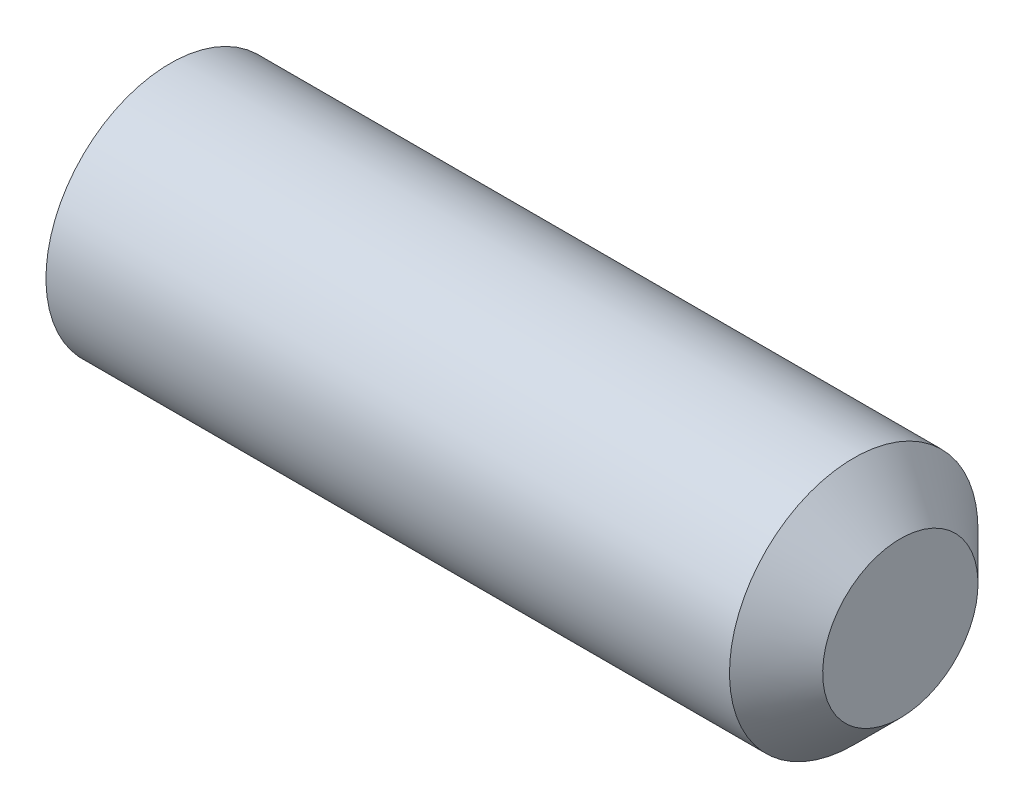
ISO-10303-21;
HEADER;
FILE_DESCRIPTION(('STEP AP214'),'2;1');
FILE_NAME('part.step','',(''),(''),'','','');
FILE_SCHEMA(('AUTOMOTIVE_DESIGN { 1 0 10303 214 1 1 1 1 }'));
ENDSEC;
DATA;
#1=APPLICATION_CONTEXT('core data for automotive mechanical design processes');
#2=APPLICATION_PROTOCOL_DEFINITION('international standard','automotive_design',2000,#1);
#3=PRODUCT_CONTEXT('',#1,'mechanical');
#4=PRODUCT('Part','Part','',(#3));
#5=PRODUCT_RELATED_PRODUCT_CATEGORY('part','',(#4));
#6=PRODUCT_DEFINITION_FORMATION('','',#4);
#7=PRODUCT_DEFINITION_CONTEXT('part definition',#1,'design');
#8=PRODUCT_DEFINITION('design','',#6,#7);
#9=PRODUCT_DEFINITION_SHAPE('','',#8);
#10=(LENGTH_UNIT() NAMED_UNIT(*) SI_UNIT(.MILLI.,.METRE.));
#11=(NAMED_UNIT(*) PLANE_ANGLE_UNIT() SI_UNIT($,.RADIAN.));
#12=(NAMED_UNIT(*) SI_UNIT($,.STERADIAN.) SOLID_ANGLE_UNIT());
#13=UNCERTAINTY_MEASURE_WITH_UNIT(LENGTH_MEASURE(1.E-05),#10,'distance_accuracy_value','');
#14=(GEOMETRIC_REPRESENTATION_CONTEXT(3) GLOBAL_UNCERTAINTY_ASSIGNED_CONTEXT((#13)) GLOBAL_UNIT_ASSIGNED_CONTEXT((#10,
#11,#12)) REPRESENTATION_CONTEXT('',''));
#15=CARTESIAN_POINT('',(0.,0.,0.));
#16=DIRECTION('',(0.,0.,1.));
#17=DIRECTION('',(1.,0.,0.));
#18=AXIS2_PLACEMENT_3D('',#15,#16,#17);
#19=CARTESIAN_POINT('',(0.66666666666667,0.,0.));
#20=DIRECTION('',(-1.,0.,0.));
#21=DIRECTION('',(0.,-1.,0.));
#22=AXIS2_PLACEMENT_3D('',#19,#20,#21);
#23=CONICAL_SURFACE('',#22,0.,1.04719755119661);
#24=CARTESIAN_POINT('',(0.,0.,0.));
#25=DIRECTION('',(-1.,0.,0.));
#26=DIRECTION('',(0.,-1.,0.));
#27=AXIS2_PLACEMENT_3D('',#24,#25,#26);
#28=CIRCLE('',#27,1.1547005383793);
#29=CARTESIAN_POINT('',(0.,0.,1.1547005383793));
#30=VERTEX_POINT('',#29);
#31=CARTESIAN_POINT('',(0.,1.00000000000008,0.577350269189584));
#32=VERTEX_POINT('',#31);
#33=EDGE_CURVE('E133',#30,#32,#28,.T.);
#34=ORIENTED_EDGE('',*,*,#33,.T.);
#35=CARTESIAN_POINT('',(-6.66766656399386E-05,1.0002,0.577234799135792));
#36=CARTESIAN_POINT('',(0.0145910263508786,0.956252680601721,0.602607795820553));
#37=CARTESIAN_POINT('',(0.0279222763791292,0.911926016050181,0.628199807531665));
#38=CARTESIAN_POINT('',(0.0511934923765662,0.822504925328881,0.679827098330841));
#39=CARTESIAN_POINT('',(0.0611252234502379,0.777408908798272,0.70586329561417));
#40=CARTESIAN_POINT('',(0.0765873051179379,0.687775829477387,0.757612978088382));
#41=CARTESIAN_POINT('',(0.0822205319010621,0.643252567766787,0.783318495222199));
#42=CARTESIAN_POINT('',(0.0889487113597592,0.55399626028499,0.83485064837369));
#43=CARTESIAN_POINT('',(0.0900492320783482,0.509263539518514,0.860677096749802));
#44=CARTESIAN_POINT('',(0.0877749477018722,0.425658889182662,0.908946264126714));
#45=CARTESIAN_POINT('',(0.0849585611365999,0.386774523211241,0.931396163287584));
#46=CARTESIAN_POINT('',(0.076027549782657,0.30925915501482,0.976149681982124));
#47=CARTESIAN_POINT('',(0.0699098662457068,0.270628421438366,0.998453146411484));
#48=CARTESIAN_POINT('',(0.0546142742741816,0.192952883515859,1.0432991391405));
#49=CARTESIAN_POINT('',(0.0453714478310434,0.153917923728835,1.06583598368134));
#50=CARTESIAN_POINT('',(0.0243931542444718,0.0764306187239892,1.11057330008467));
#51=CARTESIAN_POINT('',(0.012662624866338,0.0379772787061413,1.13277434629522));
#52=CARTESIAN_POINT('',(-6.66766656665625E-05,-0.000200000000000213,1.15481600843314));
#53=B_SPLINE_CURVE_WITH_KNOTS('',3,(#35,#36,#37,#38,#39,#40,#41,#42,#43,#44,#45,#46,#47,#48,#49,
#50,#51,#52),.UNSPECIFIED.,.F.,.F.,(4,2,2,2,2,2,2,2,4),(0.,0.158523820030115,0.317428970089341,
0.472400167924632,0.627180939971647,0.762016584872715,0.896977373984243,1.03493410168669,
1.17261952416174),.UNSPECIFIED.);
#54=EDGE_CURVE('E11',#32,#30,#53,.T.);
#55=ORIENTED_EDGE('',*,*,#54,.T.);
#56=EDGE_LOOP('',(#34,#55));
#57=FACE_BOUND('',#56,.T.);
#58=ADVANCED_FACE('F31',(#57),#23,.F.);
#59=CARTESIAN_POINT('',(0.,-1.,0.57735026918963));
#60=VERTEX_POINT('',#59);
#61=EDGE_CURVE('E129',#60,#30,#28,.T.);
#62=ORIENTED_EDGE('',*,*,#61,.T.);
#63=CARTESIAN_POINT('',(-6.66766656665343E-05,0.000199999999999947,1.15481600843314));
#64=CARTESIAN_POINT('',(0.0145910263508542,-0.0437473193982806,1.12944301174838));
#65=CARTESIAN_POINT('',(0.0279222763791071,-0.0880739839498216,1.10385100003726));
#66=CARTESIAN_POINT('',(0.0511934923765488,-0.177495074671125,1.05222370923809));
#67=CARTESIAN_POINT('',(0.0611252234502229,-0.222591091201735,1.02618751195476));
#68=CARTESIAN_POINT('',(0.0765873051179279,-0.312224170522623,0.974437829480542));
#69=CARTESIAN_POINT('',(0.0822205319010547,-0.356747432233225,0.948732312346724));
#70=CARTESIAN_POINT('',(0.0889487113597567,-0.446003739715024,0.897200159195231));
#71=CARTESIAN_POINT('',(0.0900492320783479,-0.490736460481502,0.871373710819119));
#72=CARTESIAN_POINT('',(0.0877749477018758,-0.574341110817354,0.823104543442207));
#73=CARTESIAN_POINT('',(0.0849585611366055,-0.613225476788773,0.800654644281338));
#74=CARTESIAN_POINT('',(0.0760275497826669,-0.690740844985192,0.755901125586799));
#75=CARTESIAN_POINT('',(0.0699098662457189,-0.729371578561644,0.73359766115744));
#76=CARTESIAN_POINT('',(0.054614274274198,-0.807047116484148,0.68875166842843));
#77=CARTESIAN_POINT('',(0.045371447831062,-0.84608207627117,0.666214823887585));
#78=CARTESIAN_POINT('',(0.0243931542444946,-0.923569381276013,0.621477507484257));
#79=CARTESIAN_POINT('',(0.0126626248663628,-0.96202272129386,0.599276461273711));
#80=CARTESIAN_POINT('',(-6.66766656396783E-05,-1.0002,0.577234799135792));
#81=B_SPLINE_CURVE_WITH_KNOTS('',3,(#63,#64,#65,#66,#67,#68,#69,#70,#71,#72,#73,#74,#75,#76,#77,
#78,#79,#80),.UNSPECIFIED.,.F.,.F.,(4,2,2,2,2,2,2,2,4),(0.,0.158523820030121,0.317428970089354,
0.47240016792465,0.627180939971671,0.762016584872733,0.896977373984255,1.03493410168669,
1.17261952416174),.UNSPECIFIED.);
#82=EDGE_CURVE('E44',#30,#60,#81,.T.);
#83=ORIENTED_EDGE('',*,*,#82,.T.);
#84=EDGE_LOOP('',(#62,#83));
#85=FACE_BOUND('',#84,.T.);
#86=ADVANCED_FACE('F199',(#85),#23,.F.);
#87=CARTESIAN_POINT('',(0.,-1.,-0.57735026918963));
#88=VERTEX_POINT('',#87);
#89=EDGE_CURVE('E128',#88,#60,#28,.T.);
#90=ORIENTED_EDGE('',*,*,#89,.T.);
#91=CARTESIAN_POINT('',(-0.371835288739451,-1.,-1.49514512143379));
#92=CARTESIAN_POINT('',(-0.351115020793417,-1.,-1.45196126115335));
#93=CARTESIAN_POINT('',(-0.330613672349449,-1.,-1.40867282404241));
#94=CARTESIAN_POINT('',(-0.290163433524583,-1.,-1.32182947914252));
#95=CARTESIAN_POINT('',(-0.270214642567272,-1.,-1.2782745250976));
#96=CARTESIAN_POINT('',(-0.211145154836465,-1.,-1.14662339890629));
#97=CARTESIAN_POINT('',(-0.173052526533021,-1.,-1.05805724149112));
#98=CARTESIAN_POINT('',(-0.100245820700553,-1.,-0.876833003172523));
#99=CARTESIAN_POINT('',(-0.0656458404538963,-1.,-0.784128452056518));
#100=CARTESIAN_POINT('',(-0.00407347381842811,-1.,-0.596331746532146));
#101=CARTESIAN_POINT('',(0.0229187151521698,-1.,-0.501246505541269));
#102=CARTESIAN_POINT('',(0.0542242299650066,-1.,-0.356699986452712));
#103=CARTESIAN_POINT('',(0.0631249014530373,-1.,-0.308244163171718));
#104=CARTESIAN_POINT('',(0.0772575682431124,-1.,-0.210788870695452));
#105=CARTESIAN_POINT('',(0.0824898114648446,-1.,-0.161789438465751));
#106=CARTESIAN_POINT('',(0.0888010190182573,-1.,-0.0641060489970755));
#107=CARTESIAN_POINT('',(0.0899289949889198,-1.,-0.0154253461269865));
#108=CARTESIAN_POINT('',(0.0880670216948876,-1.,0.0818553564032658));
#109=CARTESIAN_POINT('',(0.0850768174464161,-1.,0.130455350879693));
#110=CARTESIAN_POINT('',(0.0728816782707232,-1.,0.250369589613771));
#111=CARTESIAN_POINT('',(0.0613914390151371,-1.,0.321451919115022));
#112=CARTESIAN_POINT('',(0.0317596826023959,-1.,0.462229038490167));
#113=CARTESIAN_POINT('',(0.0136101490551007,-1.,0.531922048861734));
#114=CARTESIAN_POINT('',(-0.0278697226866181,-1.,0.671415729806811));
#115=CARTESIAN_POINT('',(-0.051307168306903,-1.,0.741183729418078));
#116=CARTESIAN_POINT('',(-0.101564488246382,-1.,0.8794383193963));
#117=CARTESIAN_POINT('',(-0.12838317523044,-1.,0.947925349932574));
#118=CARTESIAN_POINT('',(-0.200053915473368,-1.,1.12214515906646));
#119=CARTESIAN_POINT('',(-0.246572305198955,-1.,1.2271857404068));
#120=CARTESIAN_POINT('',(-0.342876922247949,-1.,1.4357596810456));
#121=CARTESIAN_POINT('',(-0.392663987822206,-1.,1.5392926453335));
#122=CARTESIAN_POINT('',(-0.494336444534604,-1.,1.74546702338824));
#123=CARTESIAN_POINT('',(-0.546224181866939,-1.,1.84810727554001));
#124=CARTESIAN_POINT('',(-0.651338368835187,-1.,2.05270058021729));
#125=CARTESIAN_POINT('',(-0.704564862672294,-1.,2.15465360991175));
#126=CARTESIAN_POINT('',(-0.806866916911162,-1.,2.34846553091286));
#127=CARTESIAN_POINT('',(-0.855859658963996,-1.,2.44036823161574));
#128=CARTESIAN_POINT('',(-0.954403132828168,-1.,2.62387799005304));
#129=CARTESIAN_POINT('',(-1.00395388528944,-1.,2.7154850366839));
#130=CARTESIAN_POINT('',(-1.10334710767978,-1.,2.89823865557597));
#131=CARTESIAN_POINT('',(-1.15318851504097,-1.,2.98938580641159));
#132=CARTESIAN_POINT('',(-1.25319572337608,-1.,3.17149583112626));
#133=CARTESIAN_POINT('',(-1.3033615072371,-1.,3.26245871439939));
#134=CARTESIAN_POINT('',(-1.35364621220491,-1.,3.3533553920818));
#135=B_SPLINE_CURVE_WITH_KNOTS('',3,(#91,#92,#93,#94,#95,#96,#97,#98,#99,#100,#101,#102,#103,
#104,#105,#106,#107,#108,#109,#110,#111,#112,#113,#114,#115,#116,#117,#118,#119,#120,#121,#122,
#123,#124,#125,#126,#127,#128,#129,#130,#131,#132,#133,#134),.UNSPECIFIED.,.F.,.F.,(4,2,2,2,2,2,
2,2,2,2,2,2,2,2,2,2,2,2,2,2,2,4),(0.,0.143690341820654,0.287406372566282,0.576560332877511,
0.873259488934062,1.1691790700001,1.31686338831961,1.46453772487646,1.61044269221663,
1.75635669390456,1.97192533331902,2.18775432802318,2.40842600301171,2.62902040304942,
2.97355048126465,3.3181692618629,3.66318417395138,4.00821049225249,4.32064609598604,
4.63309330006995,4.94474578248769,5.25638195528649),.UNSPECIFIED.);
#136=EDGE_CURVE('E175',#60,#88,#135,.F.);
#137=ORIENTED_EDGE('',*,*,#136,.T.);
#138=EDGE_LOOP('',(#90,#137));
#139=FACE_BOUND('',#138,.T.);
#140=ADVANCED_FACE('F205',(#139),#23,.F.);
#141=CARTESIAN_POINT('',(0.,0.,-1.1547005383793));
#142=VERTEX_POINT('',#141);
#143=EDGE_CURVE('E227',#142,#88,#28,.T.);
#144=ORIENTED_EDGE('',*,*,#143,.T.);
#145=CARTESIAN_POINT('',(-6.66766656397488E-05,-1.0002,-0.577234799135792));
#146=CARTESIAN_POINT('',(0.0145910263508787,-0.956252680601721,-0.602607795820553));
#147=CARTESIAN_POINT('',(0.0279222763791293,-0.911926016050181,-0.628199807531665));
#148=CARTESIAN_POINT('',(0.0511934923765663,-0.822504925328881,-0.679827098330841));
#149=CARTESIAN_POINT('',(0.0611252234502379,-0.777408908798272,-0.70586329561417));
#150=CARTESIAN_POINT('',(0.0765873051179379,-0.687775829477386,-0.757612978088382));
#151=CARTESIAN_POINT('',(0.0822205319010621,-0.643252567766787,-0.783318495222199));
#152=CARTESIAN_POINT('',(0.0889487113597593,-0.55399626028499,-0.83485064837369));
#153=CARTESIAN_POINT('',(0.0900492320783483,-0.509263539518514,-0.860677096749802));
#154=CARTESIAN_POINT('',(0.0877749477018723,-0.425658889182662,-0.908946264126714));
#155=CARTESIAN_POINT('',(0.0849585611365998,-0.386774523211241,-0.931396163287584));
#156=CARTESIAN_POINT('',(0.076027549782657,-0.30925915501482,-0.976149681982124));
#157=CARTESIAN_POINT('',(0.0699098662457068,-0.270628421438366,-0.998453146411484));
#158=CARTESIAN_POINT('',(0.0546142742741816,-0.192952883515858,-1.0432991391405));
#159=CARTESIAN_POINT('',(0.0453714478310435,-0.153917923728835,-1.06583598368134));
#160=CARTESIAN_POINT('',(0.0243931542444718,-0.0764306187239891,-1.11057330008467));
#161=CARTESIAN_POINT('',(0.0126626248663379,-0.0379772787061413,-1.13277434629522));
#162=CARTESIAN_POINT('',(-6.6676665666549E-05,0.0002000000000002,-1.15481600843314));
#163=B_SPLINE_CURVE_WITH_KNOTS('',3,(#145,#146,#147,#148,#149,#150,#151,#152,#153,#154,#155,
#156,#157,#158,#159,#160,#161,#162),.UNSPECIFIED.,.F.,.F.,(4,2,2,2,2,2,2,2,4),(0.,
0.158523820030115,0.317428970089341,0.472400167924632,0.627180939971647,0.762016584872715,
0.896977373984243,1.03493410168669,1.17261952416174),.UNSPECIFIED.);
#164=EDGE_CURVE('E170',#88,#142,#163,.T.);
#165=ORIENTED_EDGE('',*,*,#164,.T.);
#166=EDGE_LOOP('',(#144,#165));
#167=FACE_BOUND('',#166,.T.);
#168=ADVANCED_FACE('F217',(#167),#23,.F.);
#169=CARTESIAN_POINT('',(0.,1.,-0.57735026918963));
#170=VERTEX_POINT('',#169);
#171=EDGE_CURVE('E225',#170,#142,#28,.T.);
#172=ORIENTED_EDGE('',*,*,#171,.T.);
#173=CARTESIAN_POINT('',(-6.66766656665343E-05,-0.000199999999999947,-1.15481600843314));
#174=CARTESIAN_POINT('',(0.0145910263508542,0.0437473193982806,-1.12944301174838));
#175=CARTESIAN_POINT('',(0.0279222763791071,0.0880739839498216,-1.10385100003726));
#176=CARTESIAN_POINT('',(0.0511934923765488,0.177495074671125,-1.05222370923809));
#177=CARTESIAN_POINT('',(0.061125223450223,0.222591091201735,-1.02618751195476));
#178=CARTESIAN_POINT('',(0.0765873051179279,0.312224170522623,-0.974437829480542));
#179=CARTESIAN_POINT('',(0.0822205319010546,0.356747432233225,-0.948732312346724));
#180=CARTESIAN_POINT('',(0.0889487113597566,0.446003739715024,-0.897200159195231));
#181=CARTESIAN_POINT('',(0.0900492320783478,0.490736460481502,-0.871373710819119));
#182=CARTESIAN_POINT('',(0.0877749477018759,0.574341110817354,-0.823104543442207));
#183=CARTESIAN_POINT('',(0.0849585611366055,0.613225476788773,-0.800654644281338));
#184=CARTESIAN_POINT('',(0.0760275497826668,0.690740844985192,-0.755901125586799));
#185=CARTESIAN_POINT('',(0.0699098662457188,0.729371578561644,-0.73359766115744));
#186=CARTESIAN_POINT('',(0.054614274274198,0.807047116484148,-0.68875166842843));
#187=CARTESIAN_POINT('',(0.045371447831062,0.84608207627117,-0.666214823887585));
#188=CARTESIAN_POINT('',(0.0243931542444946,0.923569381276013,-0.621477507484257));
#189=CARTESIAN_POINT('',(0.0126626248663628,0.96202272129386,-0.599276461273711));
#190=CARTESIAN_POINT('',(-6.66766656398545E-05,1.0002,-0.577234799135792));
#191=B_SPLINE_CURVE_WITH_KNOTS('',3,(#173,#174,#175,#176,#177,#178,#179,#180,#181,#182,#183,
#184,#185,#186,#187,#188,#189,#190),.UNSPECIFIED.,.F.,.F.,(4,2,2,2,2,2,2,2,4),(0.,
0.158523820030121,0.317428970089354,0.472400167924651,0.627180939971671,0.762016584872733,
0.896977373984255,1.03493410168669,1.17261952416174),.UNSPECIFIED.);
#192=EDGE_CURVE('E111',#142,#170,#191,.T.);
#193=ORIENTED_EDGE('',*,*,#192,.T.);
#194=EDGE_LOOP('',(#172,#193));
#195=FACE_BOUND('',#194,.T.);
#196=ADVANCED_FACE('F209',(#195),#23,.F.);
#197=EDGE_CURVE('E221',#32,#170,#28,.T.);
#198=ORIENTED_EDGE('',*,*,#197,.T.);
#199=CARTESIAN_POINT('',(-0.371835288739452,1.,-1.49514512143379));
#200=CARTESIAN_POINT('',(-0.351115020793417,1.,-1.45196126115335));
#201=CARTESIAN_POINT('',(-0.33061367234945,1.,-1.40867282404241));
#202=CARTESIAN_POINT('',(-0.290163433524583,1.,-1.32182947914252));
#203=CARTESIAN_POINT('',(-0.270214642567272,1.,-1.2782745250976));
#204=CARTESIAN_POINT('',(-0.211145154836466,1.,-1.14662339890629));
#205=CARTESIAN_POINT('',(-0.173052526533021,1.,-1.05805724149112));
#206=CARTESIAN_POINT('',(-0.100245820700553,1.,-0.876833003172523));
#207=CARTESIAN_POINT('',(-0.0656458404538965,1.,-0.784128452056518));
#208=CARTESIAN_POINT('',(-0.00407347381842816,1.,-0.596331746532146));
#209=CARTESIAN_POINT('',(0.0229187151521698,1.,-0.501246505541268));
#210=CARTESIAN_POINT('',(0.0542242299650066,1.,-0.356699986452711));
#211=CARTESIAN_POINT('',(0.0631249014530372,1.,-0.308244163171718));
#212=CARTESIAN_POINT('',(0.0772575682431122,1.,-0.210788870695451));
#213=CARTESIAN_POINT('',(0.0824898114648444,1.,-0.161789438465751));
#214=CARTESIAN_POINT('',(0.0888010190182571,1.,-0.0641060489970751));
#215=CARTESIAN_POINT('',(0.0899289949889195,1.,-0.0154253461269861));
#216=CARTESIAN_POINT('',(0.0880670216948874,1.,0.0818553564032661));
#217=CARTESIAN_POINT('',(0.0850768174464159,1.,0.130455350879693));
#218=CARTESIAN_POINT('',(0.0728816782707231,1.,0.250369589613771));
#219=CARTESIAN_POINT('',(0.0613914390151369,1.,0.321451919115022));
#220=CARTESIAN_POINT('',(0.0317596826023956,1.,0.462229038490166));
#221=CARTESIAN_POINT('',(0.0136101490551005,1.,0.531922048861734));
#222=CARTESIAN_POINT('',(-0.0278697226866183,1.,0.671415729806811));
#223=CARTESIAN_POINT('',(-0.0513071683069032,1.,0.741183729418078));
#224=CARTESIAN_POINT('',(-0.101564488246382,1.,0.8794383193963));
#225=CARTESIAN_POINT('',(-0.12838317523044,1.,0.947925349932574));
#226=CARTESIAN_POINT('',(-0.200053915473368,1.,1.12214515906646));
#227=CARTESIAN_POINT('',(-0.246572305198956,1.,1.2271857404068));
#228=CARTESIAN_POINT('',(-0.34287692224795,1.,1.4357596810456));
#229=CARTESIAN_POINT('',(-0.392663987822206,1.,1.5392926453335));
#230=CARTESIAN_POINT('',(-0.494336444534604,1.,1.74546702338824));
#231=CARTESIAN_POINT('',(-0.546224181866939,1.,1.84810727554001));
#232=CARTESIAN_POINT('',(-0.651338368835186,1.,2.05270058021729));
#233=CARTESIAN_POINT('',(-0.704564862672293,1.,2.15465360991175));
#234=CARTESIAN_POINT('',(-0.806866916911162,1.,2.34846553091286));
#235=CARTESIAN_POINT('',(-0.855859658963996,1.,2.44036823161574));
#236=CARTESIAN_POINT('',(-0.954403132828169,1.,2.62387799005304));
#237=CARTESIAN_POINT('',(-1.00395388528944,1.,2.7154850366839));
#238=CARTESIAN_POINT('',(-1.10334710767978,1.,2.89823865557597));
#239=CARTESIAN_POINT('',(-1.15318851504097,1.,2.98938580641159));
#240=CARTESIAN_POINT('',(-1.25319572337608,1.,3.17149583112626));
#241=CARTESIAN_POINT('',(-1.3033615072371,1.,3.26245871439939));
#242=CARTESIAN_POINT('',(-1.35364621220492,1.,3.3533553920818));
#243=B_SPLINE_CURVE_WITH_KNOTS('',3,(#199,#200,#201,#202,#203,#204,#205,#206,#207,#208,#209,
#210,#211,#212,#213,#214,#215,#216,#217,#218,#219,#220,#221,#222,#223,#224,#225,#226,#227,#228,
#229,#230,#231,#232,#233,#234,#235,#236,#237,#238,#239,#240,#241,#242),.UNSPECIFIED.,.F.,.F.,(4,
2,2,2,2,2,2,2,2,2,2,2,2,2,2,2,2,2,2,2,2,4),(0.,0.143690341820654,0.287406372566282,
0.576560332877512,0.873259488934062,1.1691790700001,1.31686338831961,1.46453772487646,
1.61044269221663,1.75635669390456,1.97192533331902,2.18775432802318,2.40842600301171,
2.62902040304942,2.97355048126465,3.3181692618629,3.66318417395138,4.00821049225249,
4.32064609598604,4.63309330006995,4.94474578248769,5.25638195528649),.UNSPECIFIED.);
#244=EDGE_CURVE('E77',#170,#32,#243,.T.);
#245=ORIENTED_EDGE('',*,*,#244,.T.);
#246=EDGE_LOOP('',(#198,#245));
#247=FACE_BOUND('',#246,.T.);
#248=ADVANCED_FACE('F201',(#247),#23,.F.);
#249=CARTESIAN_POINT('',(12.,0.,0.));
#250=DIRECTION('',(1.,0.,0.));
#251=DIRECTION('',(0.,1.,0.));
#252=AXIS2_PLACEMENT_3D('',#249,#250,#251);
#253=PLANE('',#252);
#254=CARTESIAN_POINT('',(12.,0.,0.));
#255=DIRECTION('',(-1.,0.,0.));
#256=DIRECTION('',(0.,-1.,0.));
#257=AXIS2_PLACEMENT_3D('',#254,#255,#256);
#258=CIRCLE('',#257,1.25);
#259=CARTESIAN_POINT('',(12.,-1.25,0.));
#260=VERTEX_POINT('',#259);
#261=EDGE_CURVE('E142',#260,#260,#258,.T.);
#262=ORIENTED_EDGE('',*,*,#261,.F.);
#263=EDGE_LOOP('',(#262));
#264=FACE_BOUND('',#263,.T.);
#265=ADVANCED_FACE('F33',(#264),#253,.T.);
#266=CARTESIAN_POINT('',(11.25,0.,0.));
#267=DIRECTION('',(-1.,0.,0.));
#268=DIRECTION('',(0.,-1.,0.));
#269=AXIS2_PLACEMENT_3D('',#266,#267,#268);
#270=CONICAL_SURFACE('',#269,2.,0.785398163397448);
#271=ORIENTED_EDGE('',*,*,#261,.T.);
#272=EDGE_LOOP('',(#271));
#273=FACE_BOUND('',#272,.T.);
#274=CARTESIAN_POINT('',(11.25,0.,0.));
#275=DIRECTION('',(-1.,0.,0.));
#276=DIRECTION('',(0.,-1.,0.));
#277=AXIS2_PLACEMENT_3D('',#274,#275,#276);
#278=CIRCLE('',#277,2.);
#279=CARTESIAN_POINT('',(11.25,-2.,0.));
#280=VERTEX_POINT('',#279);
#281=EDGE_CURVE('E139',#280,#280,#278,.T.);
#282=ORIENTED_EDGE('',*,*,#281,.F.);
#283=EDGE_LOOP('',(#282));
#284=FACE_BOUND('',#283,.T.);
#285=ADVANCED_FACE('F215',(#273,#284),#270,.T.);
#286=CARTESIAN_POINT('',(0.66666666666667,0.,0.));
#287=DIRECTION('',(-1.,0.,0.));
#288=DIRECTION('',(0.,-1.,0.));
#289=AXIS2_PLACEMENT_3D('',#286,#287,#288);
#290=CYLINDRICAL_SURFACE('',#289,2.);
#291=ORIENTED_EDGE('',*,*,#281,.T.);
#292=EDGE_LOOP('',(#291));
#293=FACE_BOUND('',#292,.T.);
#294=CARTESIAN_POINT('',(0.24797194061694,0.,0.));
#295=DIRECTION('',(-1.,0.,0.));
#296=DIRECTION('',(0.,-1.,0.));
#297=AXIS2_PLACEMENT_3D('',#294,#295,#296);
#298=CIRCLE('',#297,2.);
#299=CARTESIAN_POINT('',(0.24797194061694,-2.,0.));
#300=VERTEX_POINT('',#299);
#301=EDGE_CURVE('E136',#300,#300,#298,.T.);
#302=ORIENTED_EDGE('',*,*,#301,.F.);
#303=EDGE_LOOP('',(#302));
#304=FACE_BOUND('',#303,.T.);
#305=ADVANCED_FACE('F324',(#293,#304),#290,.T.);
#306=CARTESIAN_POINT('',(0.,0.,0.));
#307=DIRECTION('',(1.,0.,0.));
#308=DIRECTION('',(0.,1.,0.));
#309=AXIS2_PLACEMENT_3D('',#306,#307,#308);
#310=CONICAL_SURFACE('',#309,1.5705,1.04719755119661);
#311=ORIENTED_EDGE('',*,*,#301,.T.);
#312=EDGE_LOOP('',(#311));
#313=FACE_BOUND('',#312,.T.);
#314=CARTESIAN_POINT('',(0.,0.,0.));
#315=DIRECTION('',(-1.,0.,0.));
#316=DIRECTION('',(0.,-1.,0.));
#317=AXIS2_PLACEMENT_3D('',#314,#315,#316);
#318=CIRCLE('',#317,1.5705);
#319=CARTESIAN_POINT('',(0.,-1.5705,0.));
#320=VERTEX_POINT('',#319);
#321=EDGE_CURVE('E132',#320,#320,#318,.T.);
#322=ORIENTED_EDGE('',*,*,#321,.F.);
#323=EDGE_LOOP('',(#322));
#324=FACE_BOUND('',#323,.T.);
#325=ADVANCED_FACE('F196',(#313,#324),#310,.T.);
#326=CARTESIAN_POINT('',(0.,-1.5705,0.));
#327=DIRECTION('',(-1.,0.,0.));
#328=DIRECTION('',(0.,-1.,0.));
#329=AXIS2_PLACEMENT_3D('',#326,#327,#328);
#330=PLANE('',#329);
#331=ORIENTED_EDGE('',*,*,#321,.T.);
#332=EDGE_LOOP('',(#331));
#333=FACE_BOUND('',#332,.T.);
#334=ORIENTED_EDGE('',*,*,#61,.F.);
#335=ORIENTED_EDGE('',*,*,#89,.F.);
#336=ORIENTED_EDGE('',*,*,#143,.F.);
#337=ORIENTED_EDGE('',*,*,#171,.F.);
#338=ORIENTED_EDGE('',*,*,#197,.F.);
#339=ORIENTED_EDGE('',*,*,#33,.F.);
#340=EDGE_LOOP('',(#334,#335,#336,#337,#338,#339));
#341=FACE_BOUND('',#340,.T.);
#342=ADVANCED_FACE('F191',(#333,#341),#330,.T.);
#343=CARTESIAN_POINT('',(2.5,1.,0.57735026918963));
#344=DIRECTION('',(0.,-0.500000000000029,-0.866025403784422));
#345=DIRECTION('',(0.,0.866025403784422,-0.500000000000029));
#346=AXIS2_PLACEMENT_3D('',#343,#344,#345);
#347=PLANE('',#346);
#348=DIRECTION('',(-1.,0.,0.));
#349=VECTOR('',#348,1.);
#350=CARTESIAN_POINT('',(2.5,1.,0.57735026918963));
#351=LINE('',#350,#349);
#352=CARTESIAN_POINT('',(2.5,1.,0.57735026918963));
#353=VERTEX_POINT('',#352);
#354=EDGE_CURVE('E51',#353,#32,#351,.T.);
#355=ORIENTED_EDGE('',*,*,#354,.F.);
#356=DIRECTION('',(0.,-0.866025403784422,0.500000000000029));
#357=VECTOR('',#356,1.);
#358=CARTESIAN_POINT('',(2.5,1.,0.57735026918963));
#359=LINE('',#358,#357);
#360=CARTESIAN_POINT('',(2.5,0.,1.1547005383793));
#361=VERTEX_POINT('',#360);
#362=EDGE_CURVE('E237',#353,#361,#359,.T.);
#363=ORIENTED_EDGE('',*,*,#362,.T.);
#364=DIRECTION('',(-1.,0.,0.));
#365=VECTOR('',#364,1.);
#366=CARTESIAN_POINT('',(2.5,0.,1.1547005383793));
#367=LINE('',#366,#365);
#368=EDGE_CURVE('E125',#361,#30,#367,.T.);
#369=ORIENTED_EDGE('',*,*,#368,.T.);
#370=ORIENTED_EDGE('',*,*,#54,.F.);
#371=EDGE_LOOP('',(#355,#363,#369,#370));
#372=FACE_BOUND('',#371,.T.);
#373=ADVANCED_FACE('F187',(#372),#347,.T.);
#374=CARTESIAN_POINT('',(2.5,0.,1.1547005383793));
#375=DIRECTION('',(0.,0.500000000000029,-0.866025403784422));
#376=DIRECTION('',(0.,0.866025403784422,0.500000000000029));
#377=AXIS2_PLACEMENT_3D('',#374,#375,#376);
#378=PLANE('',#377);
#379=ORIENTED_EDGE('',*,*,#368,.F.);
#380=DIRECTION('',(0.,-0.866025403784422,-0.500000000000029));
#381=VECTOR('',#380,1.);
#382=CARTESIAN_POINT('',(2.5,0.,1.1547005383793));
#383=LINE('',#382,#381);
#384=CARTESIAN_POINT('',(2.5,-1.,0.57735026918963));
#385=VERTEX_POINT('',#384);
#386=EDGE_CURVE('E86',#361,#385,#383,.T.);
#387=ORIENTED_EDGE('',*,*,#386,.T.);
#388=DIRECTION('',(-1.,0.,0.));
#389=VECTOR('',#388,1.);
#390=CARTESIAN_POINT('',(2.5,-1.,0.57735026918963));
#391=LINE('',#390,#389);
#392=EDGE_CURVE('E122',#385,#60,#391,.T.);
#393=ORIENTED_EDGE('',*,*,#392,.T.);
#394=ORIENTED_EDGE('',*,*,#82,.F.);
#395=EDGE_LOOP('',(#379,#387,#393,#394));
#396=FACE_BOUND('',#395,.T.);
#397=ADVANCED_FACE('F184',(#396),#378,.T.);
#398=CARTESIAN_POINT('',(2.5,-1.,0.57735026918963));
#399=DIRECTION('',(0.,1.,0.));
#400=DIRECTION('',(0.,0.,1.));
#401=AXIS2_PLACEMENT_3D('',#398,#399,#400);
#402=PLANE('',#401);
#403=ORIENTED_EDGE('',*,*,#392,.F.);
#404=DIRECTION('',(0.,0.,-1.));
#405=VECTOR('',#404,1.);
#406=CARTESIAN_POINT('',(2.5,-1.,0.57735026918963));
#407=LINE('',#406,#405);
#408=CARTESIAN_POINT('',(2.5,-1.,-0.57735026918963));
#409=VERTEX_POINT('',#408);
#410=EDGE_CURVE('E106',#385,#409,#407,.T.);
#411=ORIENTED_EDGE('',*,*,#410,.T.);
#412=DIRECTION('',(-1.,0.,0.));
#413=VECTOR('',#412,1.);
#414=CARTESIAN_POINT('',(2.5,-1.,-0.57735026918963));
#415=LINE('',#414,#413);
#416=EDGE_CURVE('E103',#409,#88,#415,.T.);
#417=ORIENTED_EDGE('',*,*,#416,.T.);
#418=ORIENTED_EDGE('',*,*,#136,.F.);
#419=EDGE_LOOP('',(#403,#411,#417,#418));
#420=FACE_BOUND('',#419,.T.);
#421=ADVANCED_FACE('F167',(#420),#402,.T.);
#422=CARTESIAN_POINT('',(2.5,-1.,-0.57735026918963));
#423=DIRECTION('',(0.,0.500000000000029,0.866025403784422));
#424=DIRECTION('',(0.,-0.866025403784422,0.500000000000029));
#425=AXIS2_PLACEMENT_3D('',#422,#423,#424);
#426=PLANE('',#425);
#427=ORIENTED_EDGE('',*,*,#416,.F.);
#428=DIRECTION('',(0.,0.866025403784422,-0.500000000000029));
#429=VECTOR('',#428,1.);
#430=CARTESIAN_POINT('',(2.5,-1.,-0.57735026918963));
#431=LINE('',#430,#429);
#432=CARTESIAN_POINT('',(2.5,0.,-1.1547005383793));
#433=VERTEX_POINT('',#432);
#434=EDGE_CURVE('E97',#409,#433,#431,.T.);
#435=ORIENTED_EDGE('',*,*,#434,.T.);
#436=DIRECTION('',(-1.,0.,0.));
#437=VECTOR('',#436,1.);
#438=CARTESIAN_POINT('',(2.5,0.,-1.1547005383793));
#439=LINE('',#438,#437);
#440=EDGE_CURVE('E100',#433,#142,#439,.T.);
#441=ORIENTED_EDGE('',*,*,#440,.T.);
#442=ORIENTED_EDGE('',*,*,#164,.F.);
#443=EDGE_LOOP('',(#427,#435,#441,#442));
#444=FACE_BOUND('',#443,.T.);
#445=ADVANCED_FACE('F99',(#444),#426,.T.);
#446=CARTESIAN_POINT('',(2.5,0.,-1.1547005383793));
#447=DIRECTION('',(0.,-0.500000000000029,0.866025403784422));
#448=DIRECTION('',(0.,-0.866025403784422,-0.500000000000029));
#449=AXIS2_PLACEMENT_3D('',#446,#447,#448);
#450=PLANE('',#449);
#451=ORIENTED_EDGE('',*,*,#440,.F.);
#452=DIRECTION('',(0.,0.866025403784422,0.500000000000029));
#453=VECTOR('',#452,1.);
#454=CARTESIAN_POINT('',(2.5,0.,-1.1547005383793));
#455=LINE('',#454,#453);
#456=CARTESIAN_POINT('',(2.5,1.,-0.57735026918963));
#457=VERTEX_POINT('',#456);
#458=EDGE_CURVE('E105',#433,#457,#455,.T.);
#459=ORIENTED_EDGE('',*,*,#458,.T.);
#460=DIRECTION('',(-1.,0.,0.));
#461=VECTOR('',#460,1.);
#462=CARTESIAN_POINT('',(2.5,1.,-0.57735026918963));
#463=LINE('',#462,#461);
#464=EDGE_CURVE('E112',#457,#170,#463,.T.);
#465=ORIENTED_EDGE('',*,*,#464,.T.);
#466=ORIENTED_EDGE('',*,*,#192,.F.);
#467=EDGE_LOOP('',(#451,#459,#465,#466));
#468=FACE_BOUND('',#467,.T.);
#469=ADVANCED_FACE('F109',(#468),#450,.T.);
#470=CARTESIAN_POINT('',(2.5,1.,-0.57735026918963));
#471=DIRECTION('',(0.,-1.,0.));
#472=DIRECTION('',(0.,0.,-1.));
#473=AXIS2_PLACEMENT_3D('',#470,#471,#472);
#474=PLANE('',#473);
#475=ORIENTED_EDGE('',*,*,#464,.F.);
#476=DIRECTION('',(0.,0.,1.));
#477=VECTOR('',#476,1.);
#478=CARTESIAN_POINT('',(2.5,1.,-0.57735026918963));
#479=LINE('',#478,#477);
#480=EDGE_CURVE('E57',#457,#353,#479,.T.);
#481=ORIENTED_EDGE('',*,*,#480,.T.);
#482=ORIENTED_EDGE('',*,*,#354,.T.);
#483=ORIENTED_EDGE('',*,*,#244,.F.);
#484=EDGE_LOOP('',(#475,#481,#482,#483));
#485=FACE_BOUND('',#484,.T.);
#486=ADVANCED_FACE('F157',(#485),#474,.T.);
#487=CARTESIAN_POINT('',(2.5,0.,1.1547005383793));
#488=DIRECTION('',(1.,0.,0.));
#489=DIRECTION('',(0.,0.,-1.));
#490=AXIS2_PLACEMENT_3D('',#487,#488,#489);
#491=PLANE('',#490);
#492=ORIENTED_EDGE('',*,*,#362,.F.);
#493=ORIENTED_EDGE('',*,*,#480,.F.);
#494=ORIENTED_EDGE('',*,*,#458,.F.);
#495=ORIENTED_EDGE('',*,*,#434,.F.);
#496=ORIENTED_EDGE('',*,*,#410,.F.);
#497=ORIENTED_EDGE('',*,*,#386,.F.);
#498=EDGE_LOOP('',(#492,#493,#494,#495,#496,#497));
#499=FACE_BOUND('',#498,.T.);
#500=ADVANCED_FACE('F114',(#499),#491,.F.);
#501=CLOSED_SHELL('',(#58,#86,#140,#168,#196,#248,#265,#285,#305,#325,#342,#373,#397,#421,#445,
#469,#486,#500));
#502=MANIFOLD_SOLID_BREP('B2',#501);
#503=ADVANCED_BREP_SHAPE_REPRESENTATION('',(#18,#502),#14);
#504=SHAPE_DEFINITION_REPRESENTATION(#9,#503);
ENDSEC;
END-ISO-10303-21;
